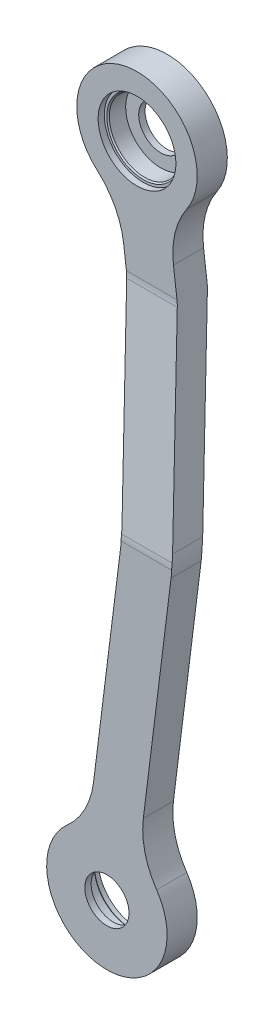
ISO-10303-21;
HEADER;
FILE_DESCRIPTION(('STEP AP214'),'2;1');
FILE_NAME('part.step','',(''),(''),'','','');
FILE_SCHEMA(('AUTOMOTIVE_DESIGN { 1 0 10303 214 1 1 1 1 }'));
ENDSEC;
DATA;
#1=APPLICATION_CONTEXT('core data for automotive mechanical design processes');
#2=APPLICATION_PROTOCOL_DEFINITION('international standard','automotive_design',2000,#1);
#3=PRODUCT_CONTEXT('',#1,'mechanical');
#4=PRODUCT('Part','Part','',(#3));
#5=PRODUCT_RELATED_PRODUCT_CATEGORY('part','',(#4));
#6=PRODUCT_DEFINITION_FORMATION('','',#4);
#7=PRODUCT_DEFINITION_CONTEXT('part definition',#1,'design');
#8=PRODUCT_DEFINITION('design','',#6,#7);
#9=PRODUCT_DEFINITION_SHAPE('','',#8);
#10=(LENGTH_UNIT() NAMED_UNIT(*) SI_UNIT(.MILLI.,.METRE.));
#11=(NAMED_UNIT(*) PLANE_ANGLE_UNIT() SI_UNIT($,.RADIAN.));
#12=(NAMED_UNIT(*) SI_UNIT($,.STERADIAN.) SOLID_ANGLE_UNIT());
#13=UNCERTAINTY_MEASURE_WITH_UNIT(LENGTH_MEASURE(1.E-05),#10,'distance_accuracy_value','');
#14=(GEOMETRIC_REPRESENTATION_CONTEXT(3) GLOBAL_UNCERTAINTY_ASSIGNED_CONTEXT((#13)) GLOBAL_UNIT_ASSIGNED_CONTEXT((#10,
#11,#12)) REPRESENTATION_CONTEXT('',''));
#15=CARTESIAN_POINT('',(0.,0.,0.));
#16=DIRECTION('',(0.,0.,1.));
#17=DIRECTION('',(1.,0.,0.));
#18=AXIS2_PLACEMENT_3D('',#15,#16,#17);
#19=CARTESIAN_POINT('',(0.,203.2,9.52499999999999));
#20=DIRECTION('',(0.,0.,1.));
#21=DIRECTION('',(1.,0.,0.));
#22=AXIS2_PLACEMENT_3D('',#19,#20,#21);
#23=CYLINDRICAL_SURFACE('',#22,6.985);
#24=CARTESIAN_POINT('',(0.,203.2,-9.52499999999997));
#25=DIRECTION('',(0.,0.,1.));
#26=DIRECTION('',(1.,0.,0.));
#27=AXIS2_PLACEMENT_3D('',#24,#25,#26);
#28=CIRCLE('',#27,6.985);
#29=CARTESIAN_POINT('',(6.985,203.2,-9.52499999999997));
#30=VERTEX_POINT('',#29);
#31=EDGE_CURVE('E195',#30,#30,#28,.T.);
#32=ORIENTED_EDGE('',*,*,#31,.F.);
#33=EDGE_LOOP('',(#32));
#34=FACE_BOUND('',#33,.T.);
#35=CARTESIAN_POINT('',(0.,203.2,-7.52474999999994));
#36=DIRECTION('',(0.,0.,1.));
#37=DIRECTION('',(1.,0.,0.));
#38=AXIS2_PLACEMENT_3D('',#35,#36,#37);
#39=CIRCLE('',#38,6.985);
#40=CARTESIAN_POINT('',(6.985,203.2,-7.52474999999994));
#41=VERTEX_POINT('',#40);
#42=EDGE_CURVE('E386',#41,#41,#39,.F.);
#43=ORIENTED_EDGE('',*,*,#42,.F.);
#44=EDGE_LOOP('',(#43));
#45=FACE_BOUND('',#44,.T.);
#46=ADVANCED_FACE('F44',(#34,#45),#23,.F.);
#47=CARTESIAN_POINT('',(0.,0.,9.52499999999999));
#48=DIRECTION('',(0.,0.,1.));
#49=DIRECTION('',(1.,0.,0.));
#50=AXIS2_PLACEMENT_3D('',#47,#48,#49);
#51=CYLINDRICAL_SURFACE('',#50,6.985);
#52=CARTESIAN_POINT('',(0.,0.,9.52499999999999));
#53=DIRECTION('',(0.,0.,1.));
#54=DIRECTION('',(1.,0.,0.));
#55=AXIS2_PLACEMENT_3D('',#52,#53,#54);
#56=CIRCLE('',#55,6.985);
#57=CARTESIAN_POINT('',(6.985,0.,9.52499999999999));
#58=VERTEX_POINT('',#57);
#59=EDGE_CURVE('E390',#58,#58,#56,.T.);
#60=ORIENTED_EDGE('',*,*,#59,.T.);
#61=EDGE_LOOP('',(#60));
#62=FACE_BOUND('',#61,.T.);
#63=CARTESIAN_POINT('',(0.,0.,7.52475));
#64=DIRECTION('',(0.,0.,-1.));
#65=DIRECTION('',(-1.,0.,0.));
#66=AXIS2_PLACEMENT_3D('',#63,#64,#65);
#67=CIRCLE('',#66,6.985);
#68=CARTESIAN_POINT('',(-6.985,0.,7.52475));
#69=VERTEX_POINT('',#68);
#70=EDGE_CURVE('E383',#69,#69,#67,.F.);
#71=ORIENTED_EDGE('',*,*,#70,.F.);
#72=EDGE_LOOP('',(#71));
#73=FACE_BOUND('',#72,.T.);
#74=ADVANCED_FACE('F515',(#62,#73),#51,.F.);
#75=CARTESIAN_POINT('',(0.,203.2,63.5));
#76=DIRECTION('',(0.,0.,-1.));
#77=DIRECTION('',(-1.,0.,0.));
#78=AXIS2_PLACEMENT_3D('',#75,#76,#77);
#79=CYLINDRICAL_SURFACE('',#78,19.05);
#80=CARTESIAN_POINT('',(0.,203.2,0.));
#81=DIRECTION('',(0.,0.,1.));
#82=DIRECTION('',(1.,0.,0.));
#83=AXIS2_PLACEMENT_3D('',#80,#81,#82);
#84=CIRCLE('',#83,19.05);
#85=CARTESIAN_POINT('',(15.7400562696877,192.469057421314,0.));
#86=VERTEX_POINT('',#85);
#87=CARTESIAN_POINT('',(-12.6142840574053,188.924764880427,0.));
#88=VERTEX_POINT('',#87);
#89=EDGE_CURVE('E410',#86,#88,#84,.T.);
#90=ORIENTED_EDGE('',*,*,#89,.F.);
#91=DIRECTION('',(0.,0.,-1.));
#92=VECTOR('',#91,1.);
#93=CARTESIAN_POINT('',(15.7400562696877,192.469057421314,63.5));
#94=LINE('',#93,#92);
#95=CARTESIAN_POINT('',(15.7400562696877,192.469057421314,-9.52499999999996));
#96=VERTEX_POINT('',#95);
#97=EDGE_CURVE('E272',#86,#96,#94,.T.);
#98=ORIENTED_EDGE('',*,*,#97,.T.);
#99=CARTESIAN_POINT('',(0.,203.2,-9.52499999999996));
#100=DIRECTION('',(0.,0.,-1.));
#101=DIRECTION('',(0.,1.,0.));
#102=AXIS2_PLACEMENT_3D('',#99,#100,#101);
#103=CIRCLE('',#102,19.05);
#104=CARTESIAN_POINT('',(-12.6142840574053,188.924764880427,-9.52499999999996));
#105=VERTEX_POINT('',#104);
#106=EDGE_CURVE('E194',#105,#96,#103,.T.);
#107=ORIENTED_EDGE('',*,*,#106,.F.);
#108=DIRECTION('',(0.,0.,-1.));
#109=VECTOR('',#108,1.);
#110=CARTESIAN_POINT('',(-12.6142840574053,188.924764880427,63.5));
#111=LINE('',#110,#109);
#112=EDGE_CURVE('E269',#105,#88,#111,.F.);
#113=ORIENTED_EDGE('',*,*,#112,.T.);
#114=EDGE_LOOP('',(#90,#98,#107,#113));
#115=FACE_BOUND('',#114,.T.);
#116=ADVANCED_FACE('F474',(#115),#79,.T.);
#117=CARTESIAN_POINT('',(-5.72822414760456,185.031622303717,63.5));
#118=DIRECTION('',(0.992277876713668,0.124034734589208,0.));
#119=DIRECTION('',(-0.124034734589208,0.992277876713668,0.));
#120=AXIS2_PLACEMENT_3D('',#117,#118,#119);
#121=PLANE('',#120);
#122=DIRECTION('',(0.124034734589208,-0.992277876713668,0.));
#123=VECTOR('',#122,1.);
#124=CARTESIAN_POINT('',(-5.72822414760456,185.031622303717,0.));
#125=LINE('',#124,#123);
#126=CARTESIAN_POINT('',(-4.22947139875191,173.041600312896,0.));
#127=VERTEX_POINT('',#126);
#128=CARTESIAN_POINT('',(-3.35517156318954,166.047201628397,0.));
#129=VERTEX_POINT('',#128);
#130=EDGE_CURVE('E414',#127,#129,#125,.T.);
#131=ORIENTED_EDGE('',*,*,#130,.F.);
#132=DIRECTION('',(0.,0.,1.));
#133=VECTOR('',#132,1.);
#134=CARTESIAN_POINT('',(-4.22947139875192,173.041600312896,-9.52499999999996));
#135=LINE('',#134,#133);
#136=CARTESIAN_POINT('',(-4.22947139875191,173.041600312896,-9.52499999999996));
#137=VERTEX_POINT('',#136);
#138=EDGE_CURVE('E286',#127,#137,#135,.F.);
#139=ORIENTED_EDGE('',*,*,#138,.T.);
#140=DIRECTION('',(-0.124034734589208,0.992277876713668,0.));
#141=VECTOR('',#140,1.);
#142=CARTESIAN_POINT('',(-5.72822414760456,185.031622303717,-9.52499999999996));
#143=LINE('',#142,#141);
#144=CARTESIAN_POINT('',(-3.35517156318954,166.047201628397,-9.52499999999997));
#145=VERTEX_POINT('',#144);
#146=EDGE_CURVE('E204',#145,#137,#143,.T.);
#147=ORIENTED_EDGE('',*,*,#146,.F.);
#148=CARTESIAN_POINT('',(-3.35517156318954,166.047201628397,3.17500000000004));
#149=DIRECTION('',(0.992277876713668,0.124034734589208,0.));
#150=DIRECTION('',(0.124034734589208,-0.992277876713668,0.));
#151=AXIS2_PLACEMENT_3D('',#148,#149,#150);
#152=ELLIPSE('',#151,12.7988341754239,12.7);
#153=CARTESIAN_POINT('',(-3.11968109416278,164.163277876182,-9.38449168142734));
#154=VERTEX_POINT('',#153);
#155=EDGE_CURVE('E199',#145,#154,#152,.F.);
#156=ORIENTED_EDGE('',*,*,#155,.T.);
#157=DIRECTION('',(-0.122683226202979,0.981465809623833,-0.147219871443574));
#158=VECTOR('',#157,1.);
#159=CARTESIAN_POINT('',(-4.35529079398222,174.048155474738,-10.8672233212107));
#160=LINE('',#159,#158);
#161=CARTESIAN_POINT('',(4.30691835803929,104.750482258566,-0.472572338784876));
#162=VERTEX_POINT('',#161);
#163=EDGE_CURVE('E182',#162,#154,#160,.T.);
#164=ORIENTED_EDGE('',*,*,#163,.F.);
#165=DIRECTION('',(0.,0.,-1.));
#166=VECTOR('',#165,1.);
#167=CARTESIAN_POINT('',(4.3069183580393,104.750482258566,9.48962826438909));
#168=LINE('',#167,#166);
#169=CARTESIAN_POINT('',(4.3069183580393,104.750482258566,9.05242766121514));
#170=VERTEX_POINT('',#169);
#171=EDGE_CURVE('E283',#162,#170,#168,.F.);
#172=ORIENTED_EDGE('',*,*,#171,.T.);
#173=DIRECTION('',(0.122683226202979,-0.981465809623833,0.147219871443575));
#174=VECTOR('',#173,1.);
#175=CARTESIAN_POINT('',(-4.52732571270588,175.424434824527,-1.54866522367905));
#176=LINE('',#175,#174);
#177=CARTESIAN_POINT('',(-3.11968109416278,164.163277876183,0.140508318572661));
#178=VERTEX_POINT('',#177);
#179=EDGE_CURVE('E417',#178,#170,#176,.T.);
#180=ORIENTED_EDGE('',*,*,#179,.F.);
#181=CARTESIAN_POINT('',(-3.35517156318954,166.047201628397,12.7));
#182=DIRECTION('',(0.992277876713668,0.124034734589208,0.));
#183=DIRECTION('',(-0.124034734589208,0.992277876713668,0.));
#184=AXIS2_PLACEMENT_3D('',#181,#182,#183);
#185=ELLIPSE('',#184,12.7988341754239,12.7);
#186=EDGE_CURVE('E244',#178,#129,#185,.T.);
#187=ORIENTED_EDGE('',*,*,#186,.T.);
#188=EDGE_LOOP('',(#131,#139,#147,#156,#164,#172,#180,#187));
#189=FACE_BOUND('',#188,.T.);
#190=ADVANCED_FACE('F201',(#189),#121,.F.);
#191=CARTESIAN_POINT('',(4.70072864036003,101.6,63.5));
#192=DIRECTION('',(0.992277876713668,-0.124034734589208,0.));
#193=DIRECTION('',(0.124034734589208,0.992277876713668,0.));
#194=AXIS2_PLACEMENT_3D('',#191,#192,#193);
#195=PLANE('',#194);
#196=DIRECTION('',(0.124034734589208,0.992277876713668,0.));
#197=VECTOR('',#196,1.);
#198=CARTESIAN_POINT('',(4.70072864036003,101.6,0.));
#199=LINE('',#198,#197);
#200=CARTESIAN_POINT('',(-4.22947139875192,30.1583996871044,0.));
#201=VERTEX_POINT('',#200);
#202=CARTESIAN_POINT('',(4.30691835803929,98.4495177414341,0.));
#203=VERTEX_POINT('',#202);
#204=EDGE_CURVE('E364',#201,#203,#199,.T.);
#205=ORIENTED_EDGE('',*,*,#204,.F.);
#206=DIRECTION('',(0.,0.,1.));
#207=VECTOR('',#206,1.);
#208=CARTESIAN_POINT('',(-4.22947139875192,30.1583996871044,9.525));
#209=LINE('',#208,#207);
#210=CARTESIAN_POINT('',(-4.22947139875192,30.1583996871044,9.525));
#211=VERTEX_POINT('',#210);
#212=EDGE_CURVE('E259',#201,#211,#209,.T.);
#213=ORIENTED_EDGE('',*,*,#212,.T.);
#214=DIRECTION('',(-0.124034734589208,-0.992277876713668,0.));
#215=VECTOR('',#214,1.);
#216=CARTESIAN_POINT('',(4.70072864036003,101.6,9.52500000000001));
#217=LINE('',#216,#215);
#218=CARTESIAN_POINT('',(4.30691835803929,98.4495177414341,9.52500000000001));
#219=VERTEX_POINT('',#218);
#220=EDGE_CURVE('E348',#219,#211,#217,.T.);
#221=ORIENTED_EDGE('',*,*,#220,.F.);
#222=DIRECTION('',(0.,0.,-1.));
#223=VECTOR('',#222,1.);
#224=CARTESIAN_POINT('',(4.30691835803929,98.4495177414341,-0.0353717356109118));
#225=LINE('',#224,#223);
#226=EDGE_CURVE('E255',#219,#203,#225,.T.);
#227=ORIENTED_EDGE('',*,*,#226,.T.);
#228=EDGE_LOOP('',(#205,#213,#221,#227));
#229=FACE_BOUND('',#228,.T.);
#230=ADVANCED_FACE('F352',(#229),#195,.F.);
#231=CARTESIAN_POINT('',(0.,0.,63.5));
#232=DIRECTION('',(0.,0.,-1.));
#233=DIRECTION('',(-1.,0.,0.));
#234=AXIS2_PLACEMENT_3D('',#231,#232,#233);
#235=CYLINDRICAL_SURFACE('',#234,19.05);
#236=CARTESIAN_POINT('',(0.,0.,9.52499999999999));
#237=DIRECTION('',(0.,0.,1.));
#238=DIRECTION('',(0.,-1.,0.));
#239=AXIS2_PLACEMENT_3D('',#236,#237,#238);
#240=CIRCLE('',#239,19.05);
#241=CARTESIAN_POINT('',(-12.6142840574053,14.275235119573,9.525));
#242=VERTEX_POINT('',#241);
#243=CARTESIAN_POINT('',(15.7400562696877,10.7309425786864,9.525));
#244=VERTEX_POINT('',#243);
#245=EDGE_CURVE('E357',#242,#244,#240,.T.);
#246=ORIENTED_EDGE('',*,*,#245,.F.);
#247=DIRECTION('',(0.,0.,-1.));
#248=VECTOR('',#247,1.);
#249=CARTESIAN_POINT('',(-12.6142840574053,14.275235119573,63.5));
#250=LINE('',#249,#248);
#251=CARTESIAN_POINT('',(-12.6142840574053,14.275235119573,0.));
#252=VERTEX_POINT('',#251);
#253=EDGE_CURVE('E251',#242,#252,#250,.T.);
#254=ORIENTED_EDGE('',*,*,#253,.T.);
#255=CARTESIAN_POINT('',(0.,0.,0.));
#256=DIRECTION('',(0.,0.,-1.));
#257=DIRECTION('',(-1.,0.,0.));
#258=AXIS2_PLACEMENT_3D('',#255,#256,#257);
#259=CIRCLE('',#258,19.05);
#260=CARTESIAN_POINT('',(15.7400562696877,10.7309425786864,0.));
#261=VERTEX_POINT('',#260);
#262=EDGE_CURVE('E421',#261,#252,#259,.T.);
#263=ORIENTED_EDGE('',*,*,#262,.F.);
#264=DIRECTION('',(0.,0.,-1.));
#265=VECTOR('',#264,1.);
#266=CARTESIAN_POINT('',(15.7400562696877,10.7309425786864,63.5));
#267=LINE('',#266,#265);
#268=EDGE_CURVE('E248',#261,#244,#267,.F.);
#269=ORIENTED_EDGE('',*,*,#268,.T.);
#270=EDGE_LOOP('',(#246,#254,#263,#269));
#271=FACE_BOUND('',#270,.T.);
#272=ADVANCED_FACE('F548',(#271),#235,.T.);
#273=CARTESIAN_POINT('',(20.69927135964,101.6,63.5));
#274=DIRECTION('',(-0.992277876713668,0.124034734589208,0.));
#275=DIRECTION('',(-0.124034734589208,-0.992277876713668,0.));
#276=AXIS2_PLACEMENT_3D('',#273,#274,#275);
#277=PLANE('',#276);
#278=DIRECTION('',(0.124034734589208,0.992277876713668,0.));
#279=VECTOR('',#278,1.);
#280=CARTESIAN_POINT('',(20.69927135964,101.6,9.52500000000001));
#281=LINE('',#280,#279);
#282=CARTESIAN_POINT('',(11.5229398940776,28.1893482755007,9.525));
#283=VERTEX_POINT('',#282);
#284=CARTESIAN_POINT('',(20.3054610773192,98.4495177414341,9.52500000000001));
#285=VERTEX_POINT('',#284);
#286=EDGE_CURVE('E220',#283,#285,#281,.T.);
#287=ORIENTED_EDGE('',*,*,#286,.F.);
#288=DIRECTION('',(0.,0.,1.));
#289=VECTOR('',#288,1.);
#290=CARTESIAN_POINT('',(11.5229398940776,28.1893482755007,0.));
#291=LINE('',#290,#289);
#292=CARTESIAN_POINT('',(11.5229398940776,28.1893482755007,0.));
#293=VERTEX_POINT('',#292);
#294=EDGE_CURVE('E265',#283,#293,#291,.F.);
#295=ORIENTED_EDGE('',*,*,#294,.T.);
#296=DIRECTION('',(-0.124034734589208,-0.992277876713668,0.));
#297=VECTOR('',#296,1.);
#298=CARTESIAN_POINT('',(20.69927135964,101.6,0.));
#299=LINE('',#298,#297);
#300=CARTESIAN_POINT('',(20.3054610773192,98.4495177414341,0.));
#301=VERTEX_POINT('',#300);
#302=EDGE_CURVE('E377',#301,#293,#299,.T.);
#303=ORIENTED_EDGE('',*,*,#302,.F.);
#304=DIRECTION('',(0.,0.,-1.));
#305=VECTOR('',#304,1.);
#306=CARTESIAN_POINT('',(20.3054610773192,98.4495177414341,63.5));
#307=LINE('',#306,#305);
#308=EDGE_CURVE('E262',#301,#285,#307,.F.);
#309=ORIENTED_EDGE('',*,*,#308,.T.);
#310=EDGE_LOOP('',(#287,#295,#303,#309));
#311=FACE_BOUND('',#310,.T.);
#312=ADVANCED_FACE('F545',(#311),#277,.F.);
#313=CARTESIAN_POINT('',(10.0241871452249,187.000673715321,63.5));
#314=DIRECTION('',(-0.992277876713668,-0.124034734589208,0.));
#315=DIRECTION('',(0.124034734589208,-0.992277876713668,0.));
#316=AXIS2_PLACEMENT_3D('',#313,#314,#315);
#317=PLANE('',#316);
#318=DIRECTION('',(0.124034734589208,-0.992277876713668,0.));
#319=VECTOR('',#318,1.);
#320=CARTESIAN_POINT('',(10.0241871452249,187.000673715321,-9.52499999999996));
#321=LINE('',#320,#319);
#322=CARTESIAN_POINT('',(11.5229398940776,175.010651724499,-9.52499999999996));
#323=VERTEX_POINT('',#322);
#324=CARTESIAN_POINT('',(12.6433711560904,166.047201628397,-9.52499999999997));
#325=VERTEX_POINT('',#324);
#326=EDGE_CURVE('E361',#323,#325,#321,.T.);
#327=ORIENTED_EDGE('',*,*,#326,.F.);
#328=DIRECTION('',(0.,0.,1.));
#329=VECTOR('',#328,1.);
#330=CARTESIAN_POINT('',(11.5229398940776,175.010651724499,0.));
#331=LINE('',#330,#329);
#332=CARTESIAN_POINT('',(11.5229398940776,175.010651724499,0.));
#333=VERTEX_POINT('',#332);
#334=EDGE_CURVE('E280',#323,#333,#331,.T.);
#335=ORIENTED_EDGE('',*,*,#334,.T.);
#336=DIRECTION('',(-0.124034734589208,0.992277876713668,0.));
#337=VECTOR('',#336,1.);
#338=CARTESIAN_POINT('',(10.0241871452249,187.000673715321,0.));
#339=LINE('',#338,#337);
#340=CARTESIAN_POINT('',(12.6433711560904,166.047201628397,0.));
#341=VERTEX_POINT('',#340);
#342=EDGE_CURVE('E370',#341,#333,#339,.T.);
#343=ORIENTED_EDGE('',*,*,#342,.F.);
#344=CARTESIAN_POINT('',(12.6433711560904,166.047201628397,12.7));
#345=DIRECTION('',(-0.992277876713668,-0.124034734589208,0.));
#346=DIRECTION('',(-0.124034734589208,0.992277876713668,0.));
#347=AXIS2_PLACEMENT_3D('',#344,#345,#346);
#348=ELLIPSE('',#347,12.7988341754239,12.7);
#349=CARTESIAN_POINT('',(12.8788616251172,164.163277876183,0.140508318572664));
#350=VERTEX_POINT('',#349);
#351=EDGE_CURVE('E240',#341,#350,#348,.T.);
#352=ORIENTED_EDGE('',*,*,#351,.T.);
#353=DIRECTION('',(-0.122683226202979,0.981465809623833,-0.147219871443575));
#354=VECTOR('',#353,1.);
#355=CARTESIAN_POINT('',(11.2304201564946,177.350809625163,-1.83762144377442));
#356=LINE('',#355,#354);
#357=CARTESIAN_POINT('',(20.3054610773192,104.750482258566,9.05242766121514));
#358=VERTEX_POINT('',#357);
#359=EDGE_CURVE('E374',#358,#350,#356,.T.);
#360=ORIENTED_EDGE('',*,*,#359,.F.);
#361=DIRECTION('',(0.,0.,-1.));
#362=VECTOR('',#361,1.);
#363=CARTESIAN_POINT('',(20.3054610773192,104.750482258566,63.5));
#364=LINE('',#363,#362);
#365=CARTESIAN_POINT('',(20.3054610773192,104.750482258566,-0.472572338784876));
#366=VERTEX_POINT('',#365);
#367=EDGE_CURVE('E276',#358,#366,#364,.T.);
#368=ORIENTED_EDGE('',*,*,#367,.T.);
#369=DIRECTION('',(0.122683226202979,-0.981465809623833,0.147219871443574));
#370=VECTOR('',#369,1.);
#371=CARTESIAN_POINT('',(11.4024550752182,175.974530275374,-11.156179541306));
#372=LINE('',#371,#370);
#373=CARTESIAN_POINT('',(12.8788616251172,164.163277876182,-9.38449168142734));
#374=VERTEX_POINT('',#373);
#375=EDGE_CURVE('E356',#374,#366,#372,.T.);
#376=ORIENTED_EDGE('',*,*,#375,.F.);
#377=CARTESIAN_POINT('',(12.6433711560904,166.047201628397,3.17500000000004));
#378=DIRECTION('',(-0.992277876713668,-0.124034734589208,0.));
#379=DIRECTION('',(0.124034734589208,-0.992277876713668,0.));
#380=AXIS2_PLACEMENT_3D('',#377,#378,#379);
#381=ELLIPSE('',#380,12.7988341754239,12.7);
#382=EDGE_CURVE('E213',#374,#325,#381,.F.);
#383=ORIENTED_EDGE('',*,*,#382,.T.);
#384=EDGE_LOOP('',(#327,#335,#343,#352,#360,#368,#376,#383));
#385=FACE_BOUND('',#384,.T.);
#386=ADVANCED_FACE('F482',(#385),#317,.F.);
#387=CARTESIAN_POINT('',(-19.05,165.1,-9.52499999999996));
#388=DIRECTION('',(0.,-0.148340452930244,-0.988936352868298));
#389=DIRECTION('',(0.,0.988936352868298,-0.148340452930244));
#390=AXIS2_PLACEMENT_3D('',#387,#388,#389);
#391=PLANE('',#390);
#392=ORIENTED_EDGE('',*,*,#375,.T.);
#393=CARTESIAN_POINT('',(-4.89839699120793,101.6,0.));
#394=DIRECTION('',(0.,-0.148340452930244,-0.988936352868298));
#395=DIRECTION('',(0.,0.988936352868298,-0.148340452930244));
#396=AXIS2_PLACEMENT_3D('',#393,#394,#395);
#397=ELLIPSE('',#396,25.684160488519,25.4);
#398=CARTESIAN_POINT('',(20.4843245268396,102.536722123817,-0.140508318572622));
#399=VERTEX_POINT('',#398);
#400=EDGE_CURVE('E289',#366,#399,#397,.T.);
#401=ORIENTED_EDGE('',*,*,#400,.T.);
#402=DIRECTION('',(1.,0.,0.));
#403=VECTOR('',#402,1.);
#404=CARTESIAN_POINT('',(4.70072864036003,102.536722123817,-0.140508318572622));
#405=LINE('',#404,#403);
#406=CARTESIAN_POINT('',(4.48578180755963,102.536722123817,-0.140508318572622));
#407=VERTEX_POINT('',#406);
#408=EDGE_CURVE('E215',#399,#407,#405,.F.);
#409=ORIENTED_EDGE('',*,*,#408,.T.);
#410=CARTESIAN_POINT('',(-20.8969397104879,101.6,0.));
#411=DIRECTION('',(0.,-0.148340452930244,-0.988936352868298));
#412=DIRECTION('',(0.,-0.988936352868298,0.148340452930244));
#413=AXIS2_PLACEMENT_3D('',#410,#411,#412);
#414=ELLIPSE('',#413,25.684160488519,25.4);
#415=EDGE_CURVE('E190',#407,#162,#414,.F.);
#416=ORIENTED_EDGE('',*,*,#415,.T.);
#417=ORIENTED_EDGE('',*,*,#163,.T.);
#418=DIRECTION('',(1.,0.,0.));
#419=VECTOR('',#418,1.);
#420=CARTESIAN_POINT('',(-19.05,164.163277876182,-9.38449168142734));
#421=LINE('',#420,#419);
#422=EDGE_CURVE('E187',#154,#374,#421,.T.);
#423=ORIENTED_EDGE('',*,*,#422,.T.);
#424=EDGE_LOOP('',(#392,#401,#409,#416,#417,#423));
#425=FACE_BOUND('',#424,.T.);
#426=ADVANCED_FACE('F185',(#425),#391,.T.);
#427=CARTESIAN_POINT('',(-19.05,222.25,-9.52499999999996));
#428=DIRECTION('',(0.,0.,-1.));
#429=DIRECTION('',(0.,1.,0.));
#430=AXIS2_PLACEMENT_3D('',#427,#428,#429);
#431=PLANE('',#430);
#432=ORIENTED_EDGE('',*,*,#31,.T.);
#433=EDGE_LOOP('',(#432));
#434=FACE_BOUND('',#433,.T.);
#435=ORIENTED_EDGE('',*,*,#106,.T.);
#436=CARTESIAN_POINT('',(36.7267979626047,178.161133983065,-9.52499999999996));
#437=DIRECTION('',(0.,0.,-1.));
#438=DIRECTION('',(0.,1.,0.));
#439=AXIS2_PLACEMENT_3D('',#436,#437,#438);
#440=CIRCLE('',#439,25.4);
#441=EDGE_CURVE('E448',#96,#323,#440,.F.);
#442=ORIENTED_EDGE('',*,*,#441,.T.);
#443=ORIENTED_EDGE('',*,*,#326,.T.);
#444=DIRECTION('',(1.,0.,0.));
#445=VECTOR('',#444,1.);
#446=CARTESIAN_POINT('',(-19.05,166.047201628397,-9.52499999999996));
#447=LINE('',#446,#445);
#448=EDGE_CURVE('E209',#325,#145,#447,.F.);
#449=ORIENTED_EDGE('',*,*,#448,.T.);
#450=ORIENTED_EDGE('',*,*,#146,.T.);
#451=CARTESIAN_POINT('',(-29.4333294672791,169.89111805433,-9.52499999999996));
#452=DIRECTION('',(0.,0.,-1.));
#453=DIRECTION('',(0.,1.,0.));
#454=AXIS2_PLACEMENT_3D('',#451,#452,#453);
#455=CIRCLE('',#454,25.4);
#456=EDGE_CURVE('E454',#137,#105,#455,.F.);
#457=ORIENTED_EDGE('',*,*,#456,.T.);
#458=EDGE_LOOP('',(#435,#442,#443,#449,#450,#457));
#459=FACE_BOUND('',#458,.T.);
#460=ADVANCED_FACE('F472',(#434,#459),#431,.T.);
#461=CARTESIAN_POINT('',(-19.05,101.6,0.));
#462=DIRECTION('',(0.,0.,-1.));
#463=DIRECTION('',(-1.,0.,0.));
#464=AXIS2_PLACEMENT_3D('',#461,#462,#463);
#465=PLANE('',#464);
#466=CARTESIAN_POINT('',(0.,0.,0.));
#467=DIRECTION('',(0.,0.,-1.));
#468=DIRECTION('',(0.,1.,0.));
#469=AXIS2_PLACEMENT_3D('',#466,#467,#468);
#470=CIRCLE('',#469,12.303125);
#471=CARTESIAN_POINT('',(0.,12.303125,0.));
#472=VERTEX_POINT('',#471);
#473=EDGE_CURVE('E618',#472,#472,#470,.T.);
#474=ORIENTED_EDGE('',*,*,#473,.F.);
#475=EDGE_LOOP('',(#474));
#476=FACE_BOUND('',#475,.T.);
#477=DIRECTION('',(1.,0.,0.));
#478=VECTOR('',#477,1.);
#479=CARTESIAN_POINT('',(20.69927135964,100.652798371603,0.));
#480=LINE('',#479,#478);
#481=CARTESIAN_POINT('',(4.48539290641642,100.652798371603,0.));
#482=VERTEX_POINT('',#481);
#483=CARTESIAN_POINT('',(20.4839356256964,100.652798371603,0.));
#484=VERTEX_POINT('',#483);
#485=EDGE_CURVE('E232',#482,#484,#480,.T.);
#486=ORIENTED_EDGE('',*,*,#485,.T.);
#487=CARTESIAN_POINT('',(-4.89839699120793,101.6,0.));
#488=DIRECTION('',(0.,0.,-1.));
#489=DIRECTION('',(-1.,0.,0.));
#490=AXIS2_PLACEMENT_3D('',#487,#488,#489);
#491=CIRCLE('',#490,25.4);
#492=EDGE_CURVE('E300',#484,#301,#491,.T.);
#493=ORIENTED_EDGE('',*,*,#492,.T.);
#494=ORIENTED_EDGE('',*,*,#302,.T.);
#495=CARTESIAN_POINT('',(36.7267979626047,25.0388660169348,0.));
#496=DIRECTION('',(0.,0.,-1.));
#497=DIRECTION('',(-1.,0.,0.));
#498=AXIS2_PLACEMENT_3D('',#495,#496,#497);
#499=CIRCLE('',#498,25.4);
#500=EDGE_CURVE('E436',#293,#261,#499,.F.);
#501=ORIENTED_EDGE('',*,*,#500,.T.);
#502=ORIENTED_EDGE('',*,*,#262,.T.);
#503=CARTESIAN_POINT('',(-29.4333294672791,33.3088819456703,0.));
#504=DIRECTION('',(0.,0.,-1.));
#505=DIRECTION('',(-1.,0.,0.));
#506=AXIS2_PLACEMENT_3D('',#503,#504,#505);
#507=CIRCLE('',#506,25.4);
#508=EDGE_CURVE('E429',#252,#201,#507,.F.);
#509=ORIENTED_EDGE('',*,*,#508,.T.);
#510=ORIENTED_EDGE('',*,*,#204,.T.);
#511=CARTESIAN_POINT('',(-20.8969397104879,101.6,0.));
#512=DIRECTION('',(0.,0.,-1.));
#513=DIRECTION('',(-1.,0.,0.));
#514=AXIS2_PLACEMENT_3D('',#511,#512,#513);
#515=CIRCLE('',#514,25.4);
#516=EDGE_CURVE('E327',#203,#482,#515,.F.);
#517=ORIENTED_EDGE('',*,*,#516,.T.);
#518=EDGE_LOOP('',(#486,#493,#494,#501,#502,#509,#510,#517));
#519=FACE_BOUND('',#518,.T.);
#520=ADVANCED_FACE('F427',(#476,#519),#465,.T.);
#521=CARTESIAN_POINT('',(-19.05,-19.05,9.52499999999998));
#522=DIRECTION('',(0.,0.,1.));
#523=DIRECTION('',(0.,-1.,0.));
#524=AXIS2_PLACEMENT_3D('',#521,#522,#523);
#525=PLANE('',#524);
#526=ORIENTED_EDGE('',*,*,#59,.F.);
#527=EDGE_LOOP('',(#526));
#528=FACE_BOUND('',#527,.T.);
#529=ORIENTED_EDGE('',*,*,#286,.T.);
#530=CARTESIAN_POINT('',(-4.89839699120793,101.6,9.52500000000001));
#531=DIRECTION('',(0.,0.,1.));
#532=DIRECTION('',(0.,-1.,0.));
#533=AXIS2_PLACEMENT_3D('',#530,#531,#532);
#534=CIRCLE('',#533,25.4);
#535=CARTESIAN_POINT('',(20.4839356256964,100.652798371603,9.52500000000001));
#536=VERTEX_POINT('',#535);
#537=EDGE_CURVE('E494',#285,#536,#534,.T.);
#538=ORIENTED_EDGE('',*,*,#537,.T.);
#539=DIRECTION('',(1.,0.,0.));
#540=VECTOR('',#539,1.);
#541=CARTESIAN_POINT('',(-19.05,100.652798371603,9.52500000000001));
#542=LINE('',#541,#540);
#543=CARTESIAN_POINT('',(4.48539290641642,100.652798371603,9.52500000000001));
#544=VERTEX_POINT('',#543);
#545=EDGE_CURVE('E60',#536,#544,#542,.F.);
#546=ORIENTED_EDGE('',*,*,#545,.T.);
#547=CARTESIAN_POINT('',(-20.8969397104879,101.6,9.52500000000001));
#548=DIRECTION('',(0.,0.,1.));
#549=DIRECTION('',(0.,-1.,0.));
#550=AXIS2_PLACEMENT_3D('',#547,#548,#549);
#551=CIRCLE('',#550,25.4);
#552=EDGE_CURVE('E12',#544,#219,#551,.F.);
#553=ORIENTED_EDGE('',*,*,#552,.T.);
#554=ORIENTED_EDGE('',*,*,#220,.T.);
#555=CARTESIAN_POINT('',(-29.4333294672791,33.3088819456703,9.525));
#556=DIRECTION('',(0.,0.,1.));
#557=DIRECTION('',(0.,-1.,0.));
#558=AXIS2_PLACEMENT_3D('',#555,#556,#557);
#559=CIRCLE('',#558,25.4);
#560=EDGE_CURVE('E433',#211,#242,#559,.F.);
#561=ORIENTED_EDGE('',*,*,#560,.T.);
#562=ORIENTED_EDGE('',*,*,#245,.T.);
#563=CARTESIAN_POINT('',(36.7267979626047,25.0388660169348,9.525));
#564=DIRECTION('',(0.,0.,1.));
#565=DIRECTION('',(0.,-1.,0.));
#566=AXIS2_PLACEMENT_3D('',#563,#564,#565);
#567=CIRCLE('',#566,25.4);
#568=EDGE_CURVE('E440',#244,#283,#567,.F.);
#569=ORIENTED_EDGE('',*,*,#568,.T.);
#570=EDGE_LOOP('',(#529,#538,#546,#553,#554,#561,#562,#569));
#571=FACE_BOUND('',#570,.T.);
#572=ADVANCED_FACE('F347',(#528,#571),#525,.T.);
#573=CARTESIAN_POINT('',(-19.05,101.6,9.52500000000001));
#574=DIRECTION('',(0.,0.148340452930244,0.988936352868298));
#575=DIRECTION('',(0.,-0.988936352868298,0.148340452930244));
#576=AXIS2_PLACEMENT_3D('',#573,#574,#575);
#577=PLANE('',#576);
#578=DIRECTION('',(1.,0.,0.));
#579=VECTOR('',#578,1.);
#580=CARTESIAN_POINT('',(-19.05,102.536722123817,9.38449168142739));
#581=LINE('',#580,#579);
#582=CARTESIAN_POINT('',(4.48578180755962,102.536722123817,9.38449168142739));
#583=VERTEX_POINT('',#582);
#584=CARTESIAN_POINT('',(20.4843245268396,102.536722123817,9.38449168142739));
#585=VERTEX_POINT('',#584);
#586=EDGE_CURVE('E67',#583,#585,#581,.T.);
#587=ORIENTED_EDGE('',*,*,#586,.T.);
#588=CARTESIAN_POINT('',(-4.89839699120793,101.6,9.52500000000002));
#589=DIRECTION('',(0.,0.148340452930244,0.988936352868298));
#590=DIRECTION('',(0.,0.988936352868298,-0.148340452930244));
#591=AXIS2_PLACEMENT_3D('',#588,#589,#590);
#592=ELLIPSE('',#591,25.684160488519,25.4);
#593=EDGE_CURVE('E442',#585,#358,#592,.T.);
#594=ORIENTED_EDGE('',*,*,#593,.T.);
#595=ORIENTED_EDGE('',*,*,#359,.T.);
#596=DIRECTION('',(1.,0.,0.));
#597=VECTOR('',#596,1.);
#598=CARTESIAN_POINT('',(-3.23677135963996,164.163277876183,0.140508318572661));
#599=LINE('',#598,#597);
#600=EDGE_CURVE('E208',#350,#178,#599,.F.);
#601=ORIENTED_EDGE('',*,*,#600,.T.);
#602=ORIENTED_EDGE('',*,*,#179,.T.);
#603=CARTESIAN_POINT('',(-20.8969397104879,101.6,9.52500000000001));
#604=DIRECTION('',(0.,0.148340452930244,0.988936352868298));
#605=DIRECTION('',(0.,-0.988936352868298,0.148340452930244));
#606=AXIS2_PLACEMENT_3D('',#603,#604,#605);
#607=ELLIPSE('',#606,25.684160488519,25.4);
#608=EDGE_CURVE('E331',#170,#583,#607,.F.);
#609=ORIENTED_EDGE('',*,*,#608,.T.);
#610=EDGE_LOOP('',(#587,#594,#595,#601,#602,#609));
#611=FACE_BOUND('',#610,.T.);
#612=ADVANCED_FACE('F506',(#611),#577,.T.);
#613=CARTESIAN_POINT('',(-19.05,165.1,0.));
#614=DIRECTION('',(0.,0.,1.));
#615=DIRECTION('',(1.,0.,0.));
#616=AXIS2_PLACEMENT_3D('',#613,#614,#615);
#617=PLANE('',#616);
#618=CARTESIAN_POINT('',(0.,203.2,0.));
#619=DIRECTION('',(0.,0.,1.));
#620=DIRECTION('',(0.,-1.,0.));
#621=AXIS2_PLACEMENT_3D('',#618,#619,#620);
#622=CIRCLE('',#621,12.303125);
#623=CARTESIAN_POINT('',(0.,190.896875,0.));
#624=VERTEX_POINT('',#623);
#625=EDGE_CURVE('E637',#624,#624,#622,.T.);
#626=ORIENTED_EDGE('',*,*,#625,.F.);
#627=EDGE_LOOP('',(#626));
#628=FACE_BOUND('',#627,.T.);
#629=ORIENTED_EDGE('',*,*,#89,.T.);
#630=CARTESIAN_POINT('',(-29.4333294672791,169.89111805433,0.));
#631=DIRECTION('',(0.,0.,1.));
#632=DIRECTION('',(1.,0.,0.));
#633=AXIS2_PLACEMENT_3D('',#630,#631,#632);
#634=CIRCLE('',#633,25.4);
#635=EDGE_CURVE('E456',#88,#127,#634,.F.);
#636=ORIENTED_EDGE('',*,*,#635,.T.);
#637=ORIENTED_EDGE('',*,*,#130,.T.);
#638=DIRECTION('',(1.,0.,0.));
#639=VECTOR('',#638,1.);
#640=CARTESIAN_POINT('',(12.76177135964,166.047201628397,0.));
#641=LINE('',#640,#639);
#642=EDGE_CURVE('E236',#129,#341,#641,.T.);
#643=ORIENTED_EDGE('',*,*,#642,.T.);
#644=ORIENTED_EDGE('',*,*,#342,.T.);
#645=CARTESIAN_POINT('',(36.7267979626047,178.161133983065,0.));
#646=DIRECTION('',(0.,0.,1.));
#647=DIRECTION('',(1.,0.,0.));
#648=AXIS2_PLACEMENT_3D('',#645,#646,#647);
#649=CIRCLE('',#648,25.4);
#650=EDGE_CURVE('E451',#333,#86,#649,.F.);
#651=ORIENTED_EDGE('',*,*,#650,.T.);
#652=EDGE_LOOP('',(#629,#636,#637,#643,#644,#651));
#653=FACE_BOUND('',#652,.T.);
#654=ADVANCED_FACE('F461',(#628,#653),#617,.T.);
#655=CARTESIAN_POINT('',(0.,0.,7.52475));
#656=DIRECTION('',(0.,0.,-1.));
#657=DIRECTION('',(0.,1.,0.));
#658=AXIS2_PLACEMENT_3D('',#655,#656,#657);
#659=PLANE('',#658);
#660=CARTESIAN_POINT('',(0.,0.,7.52475));
#661=DIRECTION('',(0.,0.,-1.));
#662=DIRECTION('',(0.,1.,0.));
#663=AXIS2_PLACEMENT_3D('',#660,#661,#662);
#664=CIRCLE('',#663,11.1125);
#665=CARTESIAN_POINT('',(0.,11.1125,7.52475));
#666=VERTEX_POINT('',#665);
#667=EDGE_CURVE('E623',#666,#666,#664,.T.);
#668=ORIENTED_EDGE('',*,*,#667,.T.);
#669=EDGE_LOOP('',(#668));
#670=FACE_BOUND('',#669,.T.);
#671=ORIENTED_EDGE('',*,*,#70,.T.);
#672=EDGE_LOOP('',(#671));
#673=FACE_BOUND('',#672,.T.);
#674=ADVANCED_FACE('F533',(#670,#673),#659,.T.);
#675=CARTESIAN_POINT('',(0.,0.,0.));
#676=DIRECTION('',(0.,0.,1.));
#677=DIRECTION('',(0.,-1.,0.));
#678=AXIS2_PLACEMENT_3D('',#675,#676,#677);
#679=CYLINDRICAL_SURFACE('',#678,11.1125);
#680=CARTESIAN_POINT('',(0.,0.,2.365375));
#681=DIRECTION('',(0.,0.,-1.));
#682=DIRECTION('',(0.,1.,0.));
#683=AXIS2_PLACEMENT_3D('',#680,#681,#682);
#684=CIRCLE('',#683,11.1125);
#685=CARTESIAN_POINT('',(0.,11.1125,2.365375));
#686=VERTEX_POINT('',#685);
#687=EDGE_CURVE('E387',#686,#686,#684,.F.);
#688=ORIENTED_EDGE('',*,*,#687,.F.);
#689=EDGE_LOOP('',(#688));
#690=FACE_BOUND('',#689,.T.);
#691=ORIENTED_EDGE('',*,*,#667,.F.);
#692=EDGE_LOOP('',(#691));
#693=FACE_BOUND('',#692,.T.);
#694=ADVANCED_FACE('F599',(#690,#693),#679,.F.);
#695=CARTESIAN_POINT('',(0.,0.,1.58749999999999));
#696=DIRECTION('',(0.,0.,-1.));
#697=DIRECTION('',(0.,1.,0.));
#698=AXIS2_PLACEMENT_3D('',#695,#696,#697);
#699=CYLINDRICAL_SURFACE('',#698,12.303125);
#700=CARTESIAN_POINT('',(0.,0.,1.96850000000001));
#701=DIRECTION('',(0.,0.,-1.));
#702=DIRECTION('',(0.,1.,0.));
#703=AXIS2_PLACEMENT_3D('',#700,#701,#702);
#704=CIRCLE('',#703,12.303125);
#705=CARTESIAN_POINT('',(0.,12.303125,1.96850000000001));
#706=VERTEX_POINT('',#705);
#707=EDGE_CURVE('E615',#706,#706,#704,.T.);
#708=ORIENTED_EDGE('',*,*,#707,.F.);
#709=EDGE_LOOP('',(#708));
#710=FACE_BOUND('',#709,.T.);
#711=ORIENTED_EDGE('',*,*,#473,.T.);
#712=EDGE_LOOP('',(#711));
#713=FACE_BOUND('',#712,.T.);
#714=ADVANCED_FACE('F603',(#710,#713),#699,.F.);
#715=CARTESIAN_POINT('',(0.,0.,1.96850000000001));
#716=DIRECTION('',(0.,0.,-1.));
#717=DIRECTION('',(0.,1.,0.));
#718=AXIS2_PLACEMENT_3D('',#715,#716,#717);
#719=PLANE('',#718);
#720=CARTESIAN_POINT('',(0.,0.,1.96850000000001));
#721=DIRECTION('',(0.,0.,-1.));
#722=DIRECTION('',(0.,1.,0.));
#723=AXIS2_PLACEMENT_3D('',#720,#721,#722);
#724=CIRCLE('',#723,11.509375);
#725=CARTESIAN_POINT('',(0.,11.509375,1.96850000000001));
#726=VERTEX_POINT('',#725);
#727=EDGE_CURVE('E630',#726,#726,#724,.T.);
#728=ORIENTED_EDGE('',*,*,#727,.F.);
#729=EDGE_LOOP('',(#728));
#730=FACE_BOUND('',#729,.T.);
#731=ORIENTED_EDGE('',*,*,#707,.T.);
#732=EDGE_LOOP('',(#731));
#733=FACE_BOUND('',#732,.T.);
#734=ADVANCED_FACE('F595',(#730,#733),#719,.T.);
#735=CARTESIAN_POINT('',(0.,0.,1.96850000000001));
#736=DIRECTION('',(0.,0.,-1.));
#737=DIRECTION('',(0.,1.,0.));
#738=AXIS2_PLACEMENT_3D('',#735,#736,#737);
#739=CONICAL_SURFACE('',#738,11.509375,0.785398163397457);
#740=ORIENTED_EDGE('',*,*,#687,.T.);
#741=EDGE_LOOP('',(#740));
#742=FACE_BOUND('',#741,.T.);
#743=ORIENTED_EDGE('',*,*,#727,.T.);
#744=EDGE_LOOP('',(#743));
#745=FACE_BOUND('',#744,.T.);
#746=ADVANCED_FACE('F582',(#742,#745),#739,.F.);
#747=CARTESIAN_POINT('',(0.,203.2,-7.52474999999994));
#748=DIRECTION('',(0.,0.,1.));
#749=DIRECTION('',(0.,-1.,0.));
#750=AXIS2_PLACEMENT_3D('',#747,#748,#749);
#751=PLANE('',#750);
#752=CARTESIAN_POINT('',(0.,203.2,-7.52474999999994));
#753=DIRECTION('',(0.,0.,1.));
#754=DIRECTION('',(0.,-1.,0.));
#755=AXIS2_PLACEMENT_3D('',#752,#753,#754);
#756=CIRCLE('',#755,11.1125);
#757=CARTESIAN_POINT('',(0.,192.0875,-7.52474999999994));
#758=VERTEX_POINT('',#757);
#759=EDGE_CURVE('E645',#758,#758,#756,.T.);
#760=ORIENTED_EDGE('',*,*,#759,.T.);
#761=EDGE_LOOP('',(#760));
#762=FACE_BOUND('',#761,.T.);
#763=ORIENTED_EDGE('',*,*,#42,.T.);
#764=EDGE_LOOP('',(#763));
#765=FACE_BOUND('',#764,.T.);
#766=ADVANCED_FACE('F579',(#762,#765),#751,.T.);
#767=CARTESIAN_POINT('',(0.,203.2,0.));
#768=DIRECTION('',(0.,0.,-1.));
#769=DIRECTION('',(0.,1.,0.));
#770=AXIS2_PLACEMENT_3D('',#767,#768,#769);
#771=CYLINDRICAL_SURFACE('',#770,11.1125);
#772=CARTESIAN_POINT('',(0.,203.2,-2.36537499999995));
#773=DIRECTION('',(0.,0.,1.));
#774=DIRECTION('',(0.,-1.,0.));
#775=AXIS2_PLACEMENT_3D('',#772,#773,#774);
#776=CIRCLE('',#775,11.1125);
#777=CARTESIAN_POINT('',(0.,192.0875,-2.36537499999995));
#778=VERTEX_POINT('',#777);
#779=EDGE_CURVE('E402',#778,#778,#776,.F.);
#780=ORIENTED_EDGE('',*,*,#779,.F.);
#781=EDGE_LOOP('',(#780));
#782=FACE_BOUND('',#781,.T.);
#783=ORIENTED_EDGE('',*,*,#759,.F.);
#784=EDGE_LOOP('',(#783));
#785=FACE_BOUND('',#784,.T.);
#786=ADVANCED_FACE('F581',(#782,#785),#771,.F.);
#787=CARTESIAN_POINT('',(0.,203.2,-1.58749999999994));
#788=DIRECTION('',(0.,0.,1.));
#789=DIRECTION('',(0.,-1.,0.));
#790=AXIS2_PLACEMENT_3D('',#787,#788,#789);
#791=CYLINDRICAL_SURFACE('',#790,12.303125);
#792=CARTESIAN_POINT('',(0.,203.2,-1.96849999999996));
#793=DIRECTION('',(0.,0.,1.));
#794=DIRECTION('',(0.,-1.,0.));
#795=AXIS2_PLACEMENT_3D('',#792,#793,#794);
#796=CIRCLE('',#795,12.303125);
#797=CARTESIAN_POINT('',(0.,190.896875,-1.96849999999996));
#798=VERTEX_POINT('',#797);
#799=EDGE_CURVE('E641',#798,#798,#796,.T.);
#800=ORIENTED_EDGE('',*,*,#799,.F.);
#801=EDGE_LOOP('',(#800));
#802=FACE_BOUND('',#801,.T.);
#803=ORIENTED_EDGE('',*,*,#625,.T.);
#804=EDGE_LOOP('',(#803));
#805=FACE_BOUND('',#804,.T.);
#806=ADVANCED_FACE('F569',(#802,#805),#791,.F.);
#807=CARTESIAN_POINT('',(0.,203.2,-1.96849999999996));
#808=DIRECTION('',(0.,0.,1.));
#809=DIRECTION('',(0.,-1.,0.));
#810=AXIS2_PLACEMENT_3D('',#807,#808,#809);
#811=PLANE('',#810);
#812=CARTESIAN_POINT('',(0.,203.2,-1.96849999999996));
#813=DIRECTION('',(0.,0.,1.));
#814=DIRECTION('',(0.,-1.,0.));
#815=AXIS2_PLACEMENT_3D('',#812,#813,#814);
#816=CIRCLE('',#815,11.509375);
#817=CARTESIAN_POINT('',(0.,191.690625,-1.96849999999996));
#818=VERTEX_POINT('',#817);
#819=EDGE_CURVE('E625',#818,#818,#816,.T.);
#820=ORIENTED_EDGE('',*,*,#819,.F.);
#821=EDGE_LOOP('',(#820));
#822=FACE_BOUND('',#821,.T.);
#823=ORIENTED_EDGE('',*,*,#799,.T.);
#824=EDGE_LOOP('',(#823));
#825=FACE_BOUND('',#824,.T.);
#826=ADVANCED_FACE('F564',(#822,#825),#811,.T.);
#827=CARTESIAN_POINT('',(0.,203.2,-1.96849999999996));
#828=DIRECTION('',(0.,0.,1.));
#829=DIRECTION('',(0.,-1.,0.));
#830=AXIS2_PLACEMENT_3D('',#827,#828,#829);
#831=CONICAL_SURFACE('',#830,11.509375,0.785398163397457);
#832=ORIENTED_EDGE('',*,*,#779,.T.);
#833=EDGE_LOOP('',(#832));
#834=FACE_BOUND('',#833,.T.);
#835=ORIENTED_EDGE('',*,*,#819,.T.);
#836=EDGE_LOOP('',(#835));
#837=FACE_BOUND('',#836,.T.);
#838=ADVANCED_FACE('F559',(#834,#837),#831,.F.);
#839=CARTESIAN_POINT('',(-19.05,166.047201628397,3.17500000000004));
#840=DIRECTION('',(1.,0.,0.));
#841=DIRECTION('',(0.,0.,-1.));
#842=AXIS2_PLACEMENT_3D('',#839,#840,#841);
#843=CYLINDRICAL_SURFACE('',#842,12.7);
#844=ORIENTED_EDGE('',*,*,#155,.F.);
#845=ORIENTED_EDGE('',*,*,#448,.F.);
#846=ORIENTED_EDGE('',*,*,#382,.F.);
#847=ORIENTED_EDGE('',*,*,#422,.F.);
#848=EDGE_LOOP('',(#844,#845,#846,#847));
#849=FACE_BOUND('',#848,.T.);
#850=ADVANCED_FACE('F211',(#849),#843,.T.);
#851=CARTESIAN_POINT('',(-19.05,100.652798371603,-3.17499999999999));
#852=DIRECTION('',(1.,0.,0.));
#853=DIRECTION('',(0.,0.,-1.));
#854=AXIS2_PLACEMENT_3D('',#851,#852,#853);
#855=CYLINDRICAL_SURFACE('',#854,12.7);
#856=ORIENTED_EDGE('',*,*,#545,.F.);
#857=CARTESIAN_POINT('',(20.4839356256964,100.652798371603,9.52500000000001));
#858=CARTESIAN_POINT('',(20.4898211287138,100.810435816746,9.52500272806072));
#859=CARTESIAN_POINT('',(20.4942323398418,100.968128136471,9.52206501514447));
#860=CARTESIAN_POINT('',(20.500112556652,101.283077057591,9.51032700750373));
#861=CARTESIAN_POINT('',(20.5015866208755,101.440333941501,9.50153682717701));
#862=CARTESIAN_POINT('',(20.5016191249677,101.754411643622,9.4781121370919));
#863=CARTESIAN_POINT('',(20.5001775689606,101.911232462449,9.46347763560055));
#864=CARTESIAN_POINT('',(20.494410764145,102.224439848663,9.42836604531651));
#865=CARTESIAN_POINT('',(20.490080540254,102.380825198631,9.40787891154353));
#866=CARTESIAN_POINT('',(20.4843245268396,102.536722123818,9.38449168142739));
#867=B_SPLINE_CURVE_WITH_KNOTS('',3,(#857,#858,#859,#860,#861,#862,#863,#864,#865,#866),
.UNSPECIFIED.,.F.,.F.,(4,2,2,2,4),(0.,0.473207339761001,0.945598984864068,1.41798996175179,
1.8911966338747),.UNSPECIFIED.);
#868=EDGE_CURVE('E496',#536,#585,#867,.T.);
#869=ORIENTED_EDGE('',*,*,#868,.T.);
#870=ORIENTED_EDGE('',*,*,#586,.F.);
#871=CARTESIAN_POINT('',(4.48578180755963,102.536722123817,9.38449168142739));
#872=CARTESIAN_POINT('',(4.49153782097403,102.380825198631,9.40787891154353));
#873=CARTESIAN_POINT('',(4.49586804486502,102.224439848663,9.42836604531651));
#874=CARTESIAN_POINT('',(4.50163484968067,101.911232462449,9.46347763560055));
#875=CARTESIAN_POINT('',(4.50307640568776,101.754411643622,9.4781121370919));
#876=CARTESIAN_POINT('',(4.5030439015956,101.440333941501,9.50153682717701));
#877=CARTESIAN_POINT('',(4.50156983737209,101.283077057591,9.51032700750373));
#878=CARTESIAN_POINT('',(4.49568962056184,100.968128136471,9.52206501514447));
#879=CARTESIAN_POINT('',(4.49127840943388,100.810435816746,9.52500272806072));
#880=CARTESIAN_POINT('',(4.48539290641642,100.652798371603,9.52500000000001));
#881=B_SPLINE_CURVE_WITH_KNOTS('',3,(#871,#872,#873,#874,#875,#876,#877,#878,#879,#880),
.UNSPECIFIED.,.F.,.F.,(4,2,2,2,4),(0.,0.473206672122878,0.945597649010615,1.41798929411368,
1.8911966338747),.UNSPECIFIED.);
#882=EDGE_CURVE('E54',#583,#544,#881,.T.);
#883=ORIENTED_EDGE('',*,*,#882,.T.);
#884=EDGE_LOOP('',(#856,#869,#870,#883));
#885=FACE_BOUND('',#884,.T.);
#886=ADVANCED_FACE('F311',(#885),#855,.T.);
#887=CARTESIAN_POINT('',(-19.05,100.652798371603,-12.7));
#888=DIRECTION('',(-1.,0.,0.));
#889=DIRECTION('',(0.,0.,1.));
#890=AXIS2_PLACEMENT_3D('',#887,#888,#889);
#891=CYLINDRICAL_SURFACE('',#890,12.7);
#892=ORIENTED_EDGE('',*,*,#408,.F.);
#893=CARTESIAN_POINT('',(20.4843245268396,102.536722123817,-0.140508318572622));
#894=CARTESIAN_POINT('',(20.490080540254,102.380825198631,-0.117121088456484));
#895=CARTESIAN_POINT('',(20.494410764145,102.224439848663,-0.0966339546835014));
#896=CARTESIAN_POINT('',(20.5001775689606,101.911232462449,-0.0615223643994581));
#897=CARTESIAN_POINT('',(20.5016191249677,101.754411643622,-0.0468878629081106));
#898=CARTESIAN_POINT('',(20.5015866208755,101.440333941501,-0.0234631728230017));
#899=CARTESIAN_POINT('',(20.500112556652,101.283077057591,-0.0146729924962764));
#900=CARTESIAN_POINT('',(20.4942323398418,100.968128136471,-0.0029349848555356));
#901=CARTESIAN_POINT('',(20.4898211287138,100.810435816746,2.72806070878036E-06));
#902=CARTESIAN_POINT('',(20.4839356256964,100.652798371603,0.));
#903=B_SPLINE_CURVE_WITH_KNOTS('',3,(#893,#894,#895,#896,#897,#898,#899,#900,#901,#902),
.UNSPECIFIED.,.F.,.F.,(4,2,2,2,4),(0.,0.473206672122878,0.945597649010615,1.41798929411368,
1.8911966338747),.UNSPECIFIED.);
#904=EDGE_CURVE('E292',#399,#484,#903,.T.);
#905=ORIENTED_EDGE('',*,*,#904,.T.);
#906=ORIENTED_EDGE('',*,*,#485,.F.);
#907=CARTESIAN_POINT('',(4.48539290641642,100.652798371603,0.));
#908=CARTESIAN_POINT('',(4.49127840943388,100.810435816746,2.72806071012773E-06));
#909=CARTESIAN_POINT('',(4.49568962056184,100.968128136471,-0.00293498485553375));
#910=CARTESIAN_POINT('',(4.50156983737209,101.283077057591,-0.0146729924962753));
#911=CARTESIAN_POINT('',(4.5030439015956,101.440333941501,-0.0234631728230021));
#912=CARTESIAN_POINT('',(4.50307640568776,101.754411643622,-0.0468878629081121));
#913=CARTESIAN_POINT('',(4.50163484968067,101.911232462449,-0.0615223643994593));
#914=CARTESIAN_POINT('',(4.49586804486502,102.224439848663,-0.0966339546835018));
#915=CARTESIAN_POINT('',(4.49153782097403,102.380825198631,-0.117121088456484));
#916=CARTESIAN_POINT('',(4.48578180755962,102.536722123818,-0.140508318572622));
#917=B_SPLINE_CURVE_WITH_KNOTS('',3,(#907,#908,#909,#910,#911,#912,#913,#914,#915,#916),
.UNSPECIFIED.,.F.,.F.,(4,2,2,2,4),(0.,0.473207339761001,0.945598984864068,1.4179899617518,
1.8911966338747),.UNSPECIFIED.);
#918=EDGE_CURVE('E318',#482,#407,#917,.T.);
#919=ORIENTED_EDGE('',*,*,#918,.T.);
#920=EDGE_LOOP('',(#892,#905,#906,#919));
#921=FACE_BOUND('',#920,.T.);
#922=ADVANCED_FACE('F305',(#921),#891,.F.);
#923=CARTESIAN_POINT('',(-19.05,166.047201628397,12.7));
#924=DIRECTION('',(-1.,0.,0.));
#925=DIRECTION('',(0.,0.,1.));
#926=AXIS2_PLACEMENT_3D('',#923,#924,#925);
#927=CYLINDRICAL_SURFACE('',#926,12.7);
#928=ORIENTED_EDGE('',*,*,#186,.F.);
#929=ORIENTED_EDGE('',*,*,#600,.F.);
#930=ORIENTED_EDGE('',*,*,#351,.F.);
#931=ORIENTED_EDGE('',*,*,#642,.F.);
#932=EDGE_LOOP('',(#928,#929,#930,#931));
#933=FACE_BOUND('',#932,.T.);
#934=ADVANCED_FACE('F310',(#933),#927,.F.);
#935=CARTESIAN_POINT('',(-29.4333294672791,33.3088819456703,63.5));
#936=DIRECTION('',(0.,0.,-1.));
#937=DIRECTION('',(-1.,0.,0.));
#938=AXIS2_PLACEMENT_3D('',#935,#936,#937);
#939=CYLINDRICAL_SURFACE('',#938,25.4);
#940=ORIENTED_EDGE('',*,*,#560,.F.);
#941=ORIENTED_EDGE('',*,*,#212,.F.);
#942=ORIENTED_EDGE('',*,*,#508,.F.);
#943=ORIENTED_EDGE('',*,*,#253,.F.);
#944=EDGE_LOOP('',(#940,#941,#942,#943));
#945=FACE_BOUND('',#944,.T.);
#946=ADVANCED_FACE('F431',(#945),#939,.F.);
#947=CARTESIAN_POINT('',(36.7267979626047,25.0388660169348,63.5));
#948=DIRECTION('',(0.,0.,-1.));
#949=DIRECTION('',(-1.,0.,0.));
#950=AXIS2_PLACEMENT_3D('',#947,#948,#949);
#951=CYLINDRICAL_SURFACE('',#950,25.4);
#952=ORIENTED_EDGE('',*,*,#568,.F.);
#953=ORIENTED_EDGE('',*,*,#268,.F.);
#954=ORIENTED_EDGE('',*,*,#500,.F.);
#955=ORIENTED_EDGE('',*,*,#294,.F.);
#956=EDGE_LOOP('',(#952,#953,#954,#955));
#957=FACE_BOUND('',#956,.T.);
#958=ADVANCED_FACE('F513',(#957),#951,.F.);
#959=CARTESIAN_POINT('',(36.7267979626047,178.161133983065,63.5));
#960=DIRECTION('',(0.,0.,-1.));
#961=DIRECTION('',(-1.,0.,0.));
#962=AXIS2_PLACEMENT_3D('',#959,#960,#961);
#963=CYLINDRICAL_SURFACE('',#962,25.4);
#964=ORIENTED_EDGE('',*,*,#650,.F.);
#965=ORIENTED_EDGE('',*,*,#334,.F.);
#966=ORIENTED_EDGE('',*,*,#441,.F.);
#967=ORIENTED_EDGE('',*,*,#97,.F.);
#968=EDGE_LOOP('',(#964,#965,#966,#967));
#969=FACE_BOUND('',#968,.T.);
#970=ADVANCED_FACE('F478',(#969),#963,.F.);
#971=CARTESIAN_POINT('',(-29.4333294672791,169.89111805433,63.5));
#972=DIRECTION('',(0.,0.,-1.));
#973=DIRECTION('',(-1.,0.,0.));
#974=AXIS2_PLACEMENT_3D('',#971,#972,#973);
#975=CYLINDRICAL_SURFACE('',#974,25.4);
#976=ORIENTED_EDGE('',*,*,#635,.F.);
#977=ORIENTED_EDGE('',*,*,#112,.F.);
#978=ORIENTED_EDGE('',*,*,#456,.F.);
#979=ORIENTED_EDGE('',*,*,#138,.F.);
#980=EDGE_LOOP('',(#976,#977,#978,#979));
#981=FACE_BOUND('',#980,.T.);
#982=ADVANCED_FACE('F469',(#981),#975,.F.);
#983=CARTESIAN_POINT('',(-4.89839699120793,101.6,63.5));
#984=DIRECTION('',(0.,0.,-1.));
#985=DIRECTION('',(-1.,0.,0.));
#986=AXIS2_PLACEMENT_3D('',#983,#984,#985);
#987=CYLINDRICAL_SURFACE('',#986,25.4);
#988=ORIENTED_EDGE('',*,*,#537,.F.);
#989=ORIENTED_EDGE('',*,*,#308,.F.);
#990=ORIENTED_EDGE('',*,*,#492,.F.);
#991=ORIENTED_EDGE('',*,*,#904,.F.);
#992=ORIENTED_EDGE('',*,*,#400,.F.);
#993=ORIENTED_EDGE('',*,*,#367,.F.);
#994=ORIENTED_EDGE('',*,*,#593,.F.);
#995=ORIENTED_EDGE('',*,*,#868,.F.);
#996=EDGE_LOOP('',(#988,#989,#990,#991,#992,#993,#994,#995));
#997=FACE_BOUND('',#996,.T.);
#998=ADVANCED_FACE('F302',(#997),#987,.T.);
#999=CARTESIAN_POINT('',(-20.8969397104879,101.6,63.5));
#1000=DIRECTION('',(0.,0.,1.));
#1001=DIRECTION('',(1.,0.,0.));
#1002=AXIS2_PLACEMENT_3D('',#999,#1000,#1001);
#1003=CYLINDRICAL_SURFACE('',#1002,25.4);
#1004=ORIENTED_EDGE('',*,*,#608,.F.);
#1005=ORIENTED_EDGE('',*,*,#171,.F.);
#1006=ORIENTED_EDGE('',*,*,#415,.F.);
#1007=ORIENTED_EDGE('',*,*,#918,.F.);
#1008=ORIENTED_EDGE('',*,*,#516,.F.);
#1009=ORIENTED_EDGE('',*,*,#226,.F.);
#1010=ORIENTED_EDGE('',*,*,#552,.F.);
#1011=ORIENTED_EDGE('',*,*,#882,.F.);
#1012=EDGE_LOOP('',(#1004,#1005,#1006,#1007,#1008,#1009,#1010,#1011));
#1013=FACE_BOUND('',#1012,.T.);
#1014=ADVANCED_FACE('F46',(#1013),#1003,.F.);
#1015=CLOSED_SHELL('',(#46,#74,#116,#190,#230,#272,#312,#386,#426,#460,#520,#572,#612,#654,#674,
#694,#714,#734,#746,#766,#786,#806,#826,#838,#850,#886,#922,#934,#946,#958,#970,#982,#998,#1014));
#1016=MANIFOLD_SOLID_BREP('B2',#1015);
#1017=ADVANCED_BREP_SHAPE_REPRESENTATION('',(#18,#1016),#14);
#1018=SHAPE_DEFINITION_REPRESENTATION(#9,#1017);
ENDSEC;
END-ISO-10303-21;
